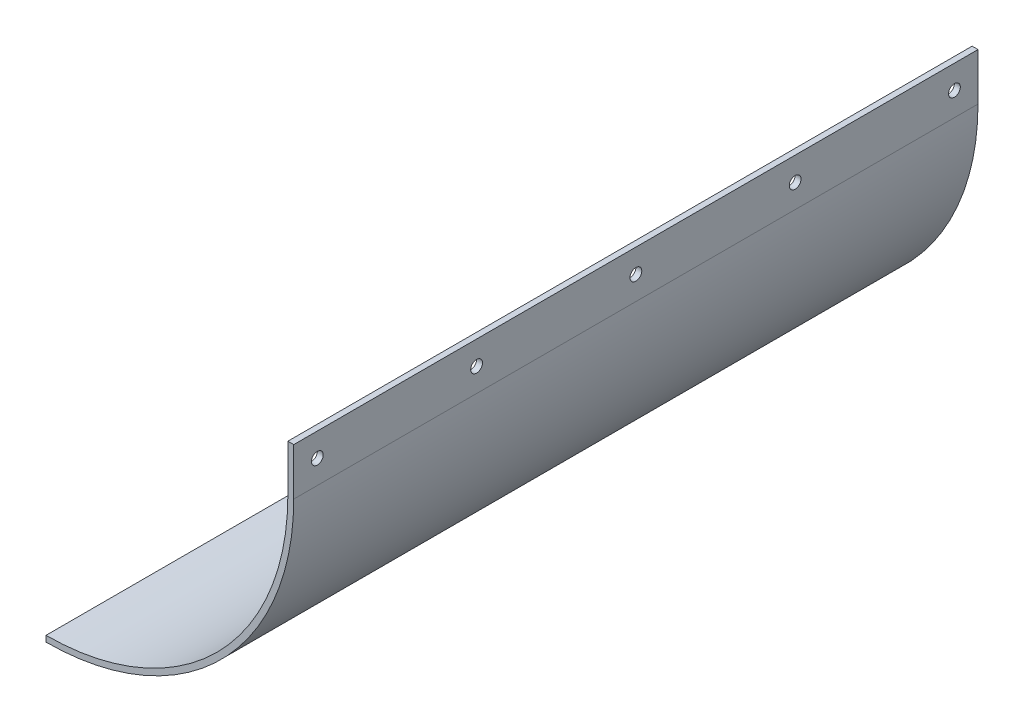
ISO-10303-21;
HEADER;
FILE_DESCRIPTION(('STEP AP214'),'2;1');
FILE_NAME('part.step','',(''),(''),'','','');
FILE_SCHEMA(('AUTOMOTIVE_DESIGN { 1 0 10303 214 1 1 1 1 }'));
ENDSEC;
DATA;
#1=APPLICATION_CONTEXT('core data for automotive mechanical design processes');
#2=APPLICATION_PROTOCOL_DEFINITION('international standard','automotive_design',2000,#1);
#3=PRODUCT_CONTEXT('',#1,'mechanical');
#4=PRODUCT('Part','Part','',(#3));
#5=PRODUCT_RELATED_PRODUCT_CATEGORY('part','',(#4));
#6=PRODUCT_DEFINITION_FORMATION('','',#4);
#7=PRODUCT_DEFINITION_CONTEXT('part definition',#1,'design');
#8=PRODUCT_DEFINITION('design','',#6,#7);
#9=PRODUCT_DEFINITION_SHAPE('','',#8);
#10=(LENGTH_UNIT() NAMED_UNIT(*) SI_UNIT(.MILLI.,.METRE.));
#11=(NAMED_UNIT(*) PLANE_ANGLE_UNIT() SI_UNIT($,.RADIAN.));
#12=(NAMED_UNIT(*) SI_UNIT($,.STERADIAN.) SOLID_ANGLE_UNIT());
#13=UNCERTAINTY_MEASURE_WITH_UNIT(LENGTH_MEASURE(1.E-05),#10,'distance_accuracy_value','');
#14=(GEOMETRIC_REPRESENTATION_CONTEXT(3) GLOBAL_UNCERTAINTY_ASSIGNED_CONTEXT((#13)) GLOBAL_UNIT_ASSIGNED_CONTEXT((#10,
#11,#12)) REPRESENTATION_CONTEXT('',''));
#15=CARTESIAN_POINT('',(0.,0.,0.));
#16=DIRECTION('',(0.,0.,1.));
#17=DIRECTION('',(1.,0.,0.));
#18=AXIS2_PLACEMENT_3D('',#15,#16,#17);
#19=CARTESIAN_POINT('',(133.35,25.4,184.15));
#20=DIRECTION('',(1.,0.,0.));
#21=DIRECTION('',(0.,0.,-1.));
#22=AXIS2_PLACEMENT_3D('',#19,#20,#21);
#23=PLANE('',#22);
#24=CARTESIAN_POINT('',(133.35,12.7,-171.45));
#25=DIRECTION('',(1.,0.,0.));
#26=DIRECTION('',(0.,0.,-1.));
#27=AXIS2_PLACEMENT_3D('',#24,#25,#26);
#28=CIRCLE('',#27,3.175);
#29=CARTESIAN_POINT('',(133.35,12.7,-174.625));
#30=VERTEX_POINT('',#29);
#31=EDGE_CURVE('E218',#30,#30,#28,.T.);
#32=ORIENTED_EDGE('',*,*,#31,.F.);
#33=EDGE_LOOP('',(#32));
#34=FACE_BOUND('',#33,.T.);
#35=CARTESIAN_POINT('',(133.35,12.7,171.45));
#36=DIRECTION('',(1.,0.,0.));
#37=DIRECTION('',(0.,0.,-1.));
#38=AXIS2_PLACEMENT_3D('',#35,#36,#37);
#39=CIRCLE('',#38,3.175);
#40=CARTESIAN_POINT('',(133.35,12.7,168.275));
#41=VERTEX_POINT('',#40);
#42=EDGE_CURVE('E216',#41,#41,#39,.T.);
#43=ORIENTED_EDGE('',*,*,#42,.F.);
#44=EDGE_LOOP('',(#43));
#45=FACE_BOUND('',#44,.T.);
#46=CARTESIAN_POINT('',(133.35,12.7,85.725));
#47=DIRECTION('',(1.,0.,0.));
#48=DIRECTION('',(0.,0.,-1.));
#49=AXIS2_PLACEMENT_3D('',#46,#47,#48);
#50=CIRCLE('',#49,3.175);
#51=CARTESIAN_POINT('',(133.35,12.7,82.55));
#52=VERTEX_POINT('',#51);
#53=EDGE_CURVE('E160',#52,#52,#50,.T.);
#54=ORIENTED_EDGE('',*,*,#53,.F.);
#55=EDGE_LOOP('',(#54));
#56=FACE_BOUND('',#55,.T.);
#57=CARTESIAN_POINT('',(133.35,12.7,-85.725));
#58=DIRECTION('',(1.,0.,0.));
#59=DIRECTION('',(0.,0.,-1.));
#60=AXIS2_PLACEMENT_3D('',#57,#58,#59);
#61=CIRCLE('',#60,3.175);
#62=CARTESIAN_POINT('',(133.35,12.7,-88.9));
#63=VERTEX_POINT('',#62);
#64=EDGE_CURVE('E145',#63,#63,#61,.T.);
#65=ORIENTED_EDGE('',*,*,#64,.F.);
#66=EDGE_LOOP('',(#65));
#67=FACE_BOUND('',#66,.T.);
#68=CARTESIAN_POINT('',(133.35,12.7,0.));
#69=DIRECTION('',(1.,0.,0.));
#70=DIRECTION('',(0.,0.,-1.));
#71=AXIS2_PLACEMENT_3D('',#68,#69,#70);
#72=CIRCLE('',#71,3.175);
#73=CARTESIAN_POINT('',(133.35,12.7,-3.175));
#74=VERTEX_POINT('',#73);
#75=EDGE_CURVE('E140',#74,#74,#72,.T.);
#76=ORIENTED_EDGE('',*,*,#75,.F.);
#77=EDGE_LOOP('',(#76));
#78=FACE_BOUND('',#77,.T.);
#79=DIRECTION('',(0.,-1.,0.));
#80=VECTOR('',#79,1.);
#81=CARTESIAN_POINT('',(133.35,25.4,-184.15));
#82=LINE('',#81,#80);
#83=CARTESIAN_POINT('',(133.35,25.4,-184.15));
#84=VERTEX_POINT('',#83);
#85=CARTESIAN_POINT('',(133.35,0.,-184.15));
#86=VERTEX_POINT('',#85);
#87=EDGE_CURVE('E116',#84,#86,#82,.T.);
#88=ORIENTED_EDGE('',*,*,#87,.F.);
#89=DIRECTION('',(0.,0.,-1.));
#90=VECTOR('',#89,1.);
#91=CARTESIAN_POINT('',(133.35,25.4,184.15));
#92=LINE('',#91,#90);
#93=CARTESIAN_POINT('',(133.35,25.4,184.15));
#94=VERTEX_POINT('',#93);
#95=EDGE_CURVE('E11',#94,#84,#92,.T.);
#96=ORIENTED_EDGE('',*,*,#95,.F.);
#97=DIRECTION('',(0.,-1.,0.));
#98=VECTOR('',#97,1.);
#99=CARTESIAN_POINT('',(133.35,25.4,184.15));
#100=LINE('',#99,#98);
#101=CARTESIAN_POINT('',(133.35,0.,184.15));
#102=VERTEX_POINT('',#101);
#103=EDGE_CURVE('E131',#94,#102,#100,.T.);
#104=ORIENTED_EDGE('',*,*,#103,.T.);
#105=DIRECTION('',(0.,0.,-1.));
#106=VECTOR('',#105,1.);
#107=CARTESIAN_POINT('',(133.35,0.,184.15));
#108=LINE('',#107,#106);
#109=EDGE_CURVE('E82',#102,#86,#108,.T.);
#110=ORIENTED_EDGE('',*,*,#109,.T.);
#111=EDGE_LOOP('',(#88,#96,#104,#110));
#112=FACE_BOUND('',#111,.T.);
#113=ADVANCED_FACE('F32',(#34,#45,#56,#67,#78,#112),#23,.T.);
#114=CARTESIAN_POINT('',(130.175,25.4,184.15));
#115=DIRECTION('',(0.,1.,0.));
#116=DIRECTION('',(0.,0.,1.));
#117=AXIS2_PLACEMENT_3D('',#114,#115,#116);
#118=PLANE('',#117);
#119=DIRECTION('',(1.,0.,0.));
#120=VECTOR('',#119,1.);
#121=CARTESIAN_POINT('',(130.175,25.4,-184.15));
#122=LINE('',#121,#120);
#123=CARTESIAN_POINT('',(130.175,25.4,-184.15));
#124=VERTEX_POINT('',#123);
#125=EDGE_CURVE('E129',#124,#84,#122,.T.);
#126=ORIENTED_EDGE('',*,*,#125,.F.);
#127=DIRECTION('',(0.,0.,-1.));
#128=VECTOR('',#127,1.);
#129=CARTESIAN_POINT('',(130.175,25.4,184.15));
#130=LINE('',#129,#128);
#131=CARTESIAN_POINT('',(130.175,25.4,184.15));
#132=VERTEX_POINT('',#131);
#133=EDGE_CURVE('E41',#132,#124,#130,.T.);
#134=ORIENTED_EDGE('',*,*,#133,.F.);
#135=DIRECTION('',(1.,0.,0.));
#136=VECTOR('',#135,1.);
#137=CARTESIAN_POINT('',(130.175,25.4,184.15));
#138=LINE('',#137,#136);
#139=EDGE_CURVE('E111',#132,#94,#138,.T.);
#140=ORIENTED_EDGE('',*,*,#139,.T.);
#141=ORIENTED_EDGE('',*,*,#95,.T.);
#142=EDGE_LOOP('',(#126,#134,#140,#141));
#143=FACE_BOUND('',#142,.T.);
#144=ADVANCED_FACE('F170',(#143),#118,.T.);
#145=CARTESIAN_POINT('',(130.175,0.,184.15));
#146=DIRECTION('',(-1.,0.,0.));
#147=DIRECTION('',(0.,0.,1.));
#148=AXIS2_PLACEMENT_3D('',#145,#146,#147);
#149=PLANE('',#148);
#150=CARTESIAN_POINT('',(130.175,12.7,-171.45));
#151=DIRECTION('',(-1.,0.,0.));
#152=DIRECTION('',(0.,0.,1.));
#153=AXIS2_PLACEMENT_3D('',#150,#151,#152);
#154=CIRCLE('',#153,3.175);
#155=CARTESIAN_POINT('',(130.175,12.7,-168.275));
#156=VERTEX_POINT('',#155);
#157=EDGE_CURVE('E35',#156,#156,#154,.T.);
#158=ORIENTED_EDGE('',*,*,#157,.F.);
#159=EDGE_LOOP('',(#158));
#160=FACE_BOUND('',#159,.T.);
#161=CARTESIAN_POINT('',(130.175,12.7,171.45));
#162=DIRECTION('',(-1.,0.,0.));
#163=DIRECTION('',(0.,0.,1.));
#164=AXIS2_PLACEMENT_3D('',#161,#162,#163);
#165=CIRCLE('',#164,3.175);
#166=CARTESIAN_POINT('',(130.175,12.7,174.625));
#167=VERTEX_POINT('',#166);
#168=EDGE_CURVE('E147',#167,#167,#165,.T.);
#169=ORIENTED_EDGE('',*,*,#168,.F.);
#170=EDGE_LOOP('',(#169));
#171=FACE_BOUND('',#170,.T.);
#172=CARTESIAN_POINT('',(130.175,12.7,85.725));
#173=DIRECTION('',(-1.,0.,0.));
#174=DIRECTION('',(0.,0.,1.));
#175=AXIS2_PLACEMENT_3D('',#172,#173,#174);
#176=CIRCLE('',#175,3.175);
#177=CARTESIAN_POINT('',(130.175,12.7,88.9));
#178=VERTEX_POINT('',#177);
#179=EDGE_CURVE('E144',#178,#178,#176,.T.);
#180=ORIENTED_EDGE('',*,*,#179,.F.);
#181=EDGE_LOOP('',(#180));
#182=FACE_BOUND('',#181,.T.);
#183=CARTESIAN_POINT('',(130.175,12.7,-85.725));
#184=DIRECTION('',(-1.,0.,0.));
#185=DIRECTION('',(0.,0.,1.));
#186=AXIS2_PLACEMENT_3D('',#183,#184,#185);
#187=CIRCLE('',#186,3.175);
#188=CARTESIAN_POINT('',(130.175,12.7,-82.55));
#189=VERTEX_POINT('',#188);
#190=EDGE_CURVE('E141',#189,#189,#187,.T.);
#191=ORIENTED_EDGE('',*,*,#190,.F.);
#192=EDGE_LOOP('',(#191));
#193=FACE_BOUND('',#192,.T.);
#194=CARTESIAN_POINT('',(130.175,12.7,0.));
#195=DIRECTION('',(-1.,0.,0.));
#196=DIRECTION('',(0.,0.,1.));
#197=AXIS2_PLACEMENT_3D('',#194,#195,#196);
#198=CIRCLE('',#197,3.175);
#199=CARTESIAN_POINT('',(130.175,12.7,3.175));
#200=VERTEX_POINT('',#199);
#201=EDGE_CURVE('E120',#200,#200,#198,.T.);
#202=ORIENTED_EDGE('',*,*,#201,.F.);
#203=EDGE_LOOP('',(#202));
#204=FACE_BOUND('',#203,.T.);
#205=DIRECTION('',(0.,1.,0.));
#206=VECTOR('',#205,1.);
#207=CARTESIAN_POINT('',(130.175,0.,-184.15));
#208=LINE('',#207,#206);
#209=CARTESIAN_POINT('',(130.175,0.,-184.15));
#210=VERTEX_POINT('',#209);
#211=EDGE_CURVE('E96',#210,#124,#208,.T.);
#212=ORIENTED_EDGE('',*,*,#211,.F.);
#213=DIRECTION('',(0.,0.,-1.));
#214=VECTOR('',#213,1.);
#215=CARTESIAN_POINT('',(130.175,0.,184.15));
#216=LINE('',#215,#214);
#217=CARTESIAN_POINT('',(130.175,0.,184.15));
#218=VERTEX_POINT('',#217);
#219=EDGE_CURVE('E90',#218,#210,#216,.T.);
#220=ORIENTED_EDGE('',*,*,#219,.F.);
#221=DIRECTION('',(0.,1.,0.));
#222=VECTOR('',#221,1.);
#223=CARTESIAN_POINT('',(130.175,0.,184.15));
#224=LINE('',#223,#222);
#225=EDGE_CURVE('E94',#218,#132,#224,.T.);
#226=ORIENTED_EDGE('',*,*,#225,.T.);
#227=ORIENTED_EDGE('',*,*,#133,.T.);
#228=EDGE_LOOP('',(#212,#220,#226,#227));
#229=FACE_BOUND('',#228,.T.);
#230=ADVANCED_FACE('F92',(#160,#171,#182,#193,#204,#229),#149,.T.);
#231=CARTESIAN_POINT('',(0.,0.,184.15));
#232=DIRECTION('',(0.,0.,-1.));
#233=DIRECTION('',(-1.,0.,0.));
#234=AXIS2_PLACEMENT_3D('',#231,#232,#233);
#235=CYLINDRICAL_SURFACE('',#234,130.175);
#236=CARTESIAN_POINT('',(0.,0.,-184.15));
#237=DIRECTION('',(0.,0.,-1.));
#238=DIRECTION('',(-1.,0.,0.));
#239=AXIS2_PLACEMENT_3D('',#236,#237,#238);
#240=CIRCLE('',#239,130.175);
#241=CARTESIAN_POINT('',(0.,-130.175,-184.15));
#242=VERTEX_POINT('',#241);
#243=EDGE_CURVE('E126',#210,#242,#240,.T.);
#244=ORIENTED_EDGE('',*,*,#243,.T.);
#245=DIRECTION('',(0.,0.,-1.));
#246=VECTOR('',#245,1.);
#247=CARTESIAN_POINT('',(0.,-130.175,184.15));
#248=LINE('',#247,#246);
#249=CARTESIAN_POINT('',(0.,-130.175,184.15));
#250=VERTEX_POINT('',#249);
#251=EDGE_CURVE('E100',#250,#242,#248,.T.);
#252=ORIENTED_EDGE('',*,*,#251,.F.);
#253=CARTESIAN_POINT('',(0.,0.,184.15));
#254=DIRECTION('',(0.,0.,-1.));
#255=DIRECTION('',(-1.,0.,0.));
#256=AXIS2_PLACEMENT_3D('',#253,#254,#255);
#257=CIRCLE('',#256,130.175);
#258=EDGE_CURVE('E103',#218,#250,#257,.T.);
#259=ORIENTED_EDGE('',*,*,#258,.F.);
#260=ORIENTED_EDGE('',*,*,#219,.T.);
#261=EDGE_LOOP('',(#244,#252,#259,#260));
#262=FACE_BOUND('',#261,.T.);
#263=ADVANCED_FACE('F104',(#262),#235,.F.);
#264=CARTESIAN_POINT('',(0.,-133.35,184.15));
#265=DIRECTION('',(-1.,0.,0.));
#266=DIRECTION('',(0.,0.,1.));
#267=AXIS2_PLACEMENT_3D('',#264,#265,#266);
#268=PLANE('',#267);
#269=DIRECTION('',(0.,1.,0.));
#270=VECTOR('',#269,1.);
#271=CARTESIAN_POINT('',(0.,-133.35,-184.15));
#272=LINE('',#271,#270);
#273=CARTESIAN_POINT('',(0.,-133.35,-184.15));
#274=VERTEX_POINT('',#273);
#275=EDGE_CURVE('E123',#274,#242,#272,.T.);
#276=ORIENTED_EDGE('',*,*,#275,.F.);
#277=DIRECTION('',(0.,0.,-1.));
#278=VECTOR('',#277,1.);
#279=CARTESIAN_POINT('',(0.,-133.35,184.15));
#280=LINE('',#279,#278);
#281=CARTESIAN_POINT('',(0.,-133.35,184.15));
#282=VERTEX_POINT('',#281);
#283=EDGE_CURVE('E135',#282,#274,#280,.T.);
#284=ORIENTED_EDGE('',*,*,#283,.F.);
#285=DIRECTION('',(0.,1.,0.));
#286=VECTOR('',#285,1.);
#287=CARTESIAN_POINT('',(0.,-133.35,184.15));
#288=LINE('',#287,#286);
#289=EDGE_CURVE('E108',#282,#250,#288,.T.);
#290=ORIENTED_EDGE('',*,*,#289,.T.);
#291=ORIENTED_EDGE('',*,*,#251,.T.);
#292=EDGE_LOOP('',(#276,#284,#290,#291));
#293=FACE_BOUND('',#292,.T.);
#294=ADVANCED_FACE('F166',(#293),#268,.T.);
#295=CARTESIAN_POINT('',(0.,0.,184.15));
#296=DIRECTION('',(0.,0.,-1.));
#297=DIRECTION('',(-1.,0.,0.));
#298=AXIS2_PLACEMENT_3D('',#295,#296,#297);
#299=CYLINDRICAL_SURFACE('',#298,133.35);
#300=CARTESIAN_POINT('',(0.,0.,-184.15));
#301=DIRECTION('',(0.,0.,-1.));
#302=DIRECTION('',(-1.,0.,0.));
#303=AXIS2_PLACEMENT_3D('',#300,#301,#302);
#304=CIRCLE('',#303,133.35);
#305=EDGE_CURVE('E119',#86,#274,#304,.T.);
#306=ORIENTED_EDGE('',*,*,#305,.F.);
#307=ORIENTED_EDGE('',*,*,#109,.F.);
#308=CARTESIAN_POINT('',(0.,0.,184.15));
#309=DIRECTION('',(0.,0.,-1.));
#310=DIRECTION('',(-1.,0.,0.));
#311=AXIS2_PLACEMENT_3D('',#308,#309,#310);
#312=CIRCLE('',#311,133.35);
#313=EDGE_CURVE('E163',#102,#282,#312,.T.);
#314=ORIENTED_EDGE('',*,*,#313,.T.);
#315=ORIENTED_EDGE('',*,*,#283,.T.);
#316=EDGE_LOOP('',(#306,#307,#314,#315));
#317=FACE_BOUND('',#316,.T.);
#318=ADVANCED_FACE('F167',(#317),#299,.T.);
#319=CARTESIAN_POINT('',(0.,0.,184.15));
#320=DIRECTION('',(0.,0.,-1.));
#321=DIRECTION('',(-1.,0.,0.));
#322=AXIS2_PLACEMENT_3D('',#319,#320,#321);
#323=PLANE('',#322);
#324=ORIENTED_EDGE('',*,*,#103,.F.);
#325=ORIENTED_EDGE('',*,*,#139,.F.);
#326=ORIENTED_EDGE('',*,*,#225,.F.);
#327=ORIENTED_EDGE('',*,*,#258,.T.);
#328=ORIENTED_EDGE('',*,*,#289,.F.);
#329=ORIENTED_EDGE('',*,*,#313,.F.);
#330=EDGE_LOOP('',(#324,#325,#326,#327,#328,#329));
#331=FACE_BOUND('',#330,.T.);
#332=ADVANCED_FACE('F110',(#331),#323,.F.);
#333=CARTESIAN_POINT('',(0.,0.,-184.15));
#334=DIRECTION('',(0.,0.,-1.));
#335=DIRECTION('',(-1.,0.,0.));
#336=AXIS2_PLACEMENT_3D('',#333,#334,#335);
#337=PLANE('',#336);
#338=ORIENTED_EDGE('',*,*,#87,.T.);
#339=ORIENTED_EDGE('',*,*,#305,.T.);
#340=ORIENTED_EDGE('',*,*,#275,.T.);
#341=ORIENTED_EDGE('',*,*,#243,.F.);
#342=ORIENTED_EDGE('',*,*,#211,.T.);
#343=ORIENTED_EDGE('',*,*,#125,.T.);
#344=EDGE_LOOP('',(#338,#339,#340,#341,#342,#343));
#345=FACE_BOUND('',#344,.T.);
#346=ADVANCED_FACE('F169',(#345),#337,.T.);
#347=CARTESIAN_POINT('',(-247.65,12.7,0.));
#348=DIRECTION('',(1.,0.,0.));
#349=DIRECTION('',(0.,0.,-1.));
#350=AXIS2_PLACEMENT_3D('',#347,#348,#349);
#351=CYLINDRICAL_SURFACE('',#350,3.175);
#352=ORIENTED_EDGE('',*,*,#201,.T.);
#353=EDGE_LOOP('',(#352));
#354=FACE_BOUND('',#353,.T.);
#355=ORIENTED_EDGE('',*,*,#75,.T.);
#356=EDGE_LOOP('',(#355));
#357=FACE_BOUND('',#356,.T.);
#358=ADVANCED_FACE('F193',(#354,#357),#351,.F.);
#359=CARTESIAN_POINT('',(-247.65,12.7,-85.725));
#360=DIRECTION('',(1.,0.,0.));
#361=DIRECTION('',(0.,0.,-1.));
#362=AXIS2_PLACEMENT_3D('',#359,#360,#361);
#363=CYLINDRICAL_SURFACE('',#362,3.175);
#364=ORIENTED_EDGE('',*,*,#190,.T.);
#365=EDGE_LOOP('',(#364));
#366=FACE_BOUND('',#365,.T.);
#367=ORIENTED_EDGE('',*,*,#64,.T.);
#368=EDGE_LOOP('',(#367));
#369=FACE_BOUND('',#368,.T.);
#370=ADVANCED_FACE('F197',(#366,#369),#363,.F.);
#371=CARTESIAN_POINT('',(-247.65,12.7,85.725));
#372=DIRECTION('',(1.,0.,0.));
#373=DIRECTION('',(0.,0.,-1.));
#374=AXIS2_PLACEMENT_3D('',#371,#372,#373);
#375=CYLINDRICAL_SURFACE('',#374,3.175);
#376=ORIENTED_EDGE('',*,*,#179,.T.);
#377=EDGE_LOOP('',(#376));
#378=FACE_BOUND('',#377,.T.);
#379=ORIENTED_EDGE('',*,*,#53,.T.);
#380=EDGE_LOOP('',(#379));
#381=FACE_BOUND('',#380,.T.);
#382=ADVANCED_FACE('F199',(#378,#381),#375,.F.);
#383=CARTESIAN_POINT('',(-247.65,12.7,171.45));
#384=DIRECTION('',(1.,0.,0.));
#385=DIRECTION('',(0.,0.,-1.));
#386=AXIS2_PLACEMENT_3D('',#383,#384,#385);
#387=CYLINDRICAL_SURFACE('',#386,3.175);
#388=ORIENTED_EDGE('',*,*,#168,.T.);
#389=EDGE_LOOP('',(#388));
#390=FACE_BOUND('',#389,.T.);
#391=ORIENTED_EDGE('',*,*,#42,.T.);
#392=EDGE_LOOP('',(#391));
#393=FACE_BOUND('',#392,.T.);
#394=ADVANCED_FACE('F202',(#390,#393),#387,.F.);
#395=CARTESIAN_POINT('',(-247.65,12.7,-171.45));
#396=DIRECTION('',(1.,0.,0.));
#397=DIRECTION('',(0.,0.,-1.));
#398=AXIS2_PLACEMENT_3D('',#395,#396,#397);
#399=CYLINDRICAL_SURFACE('',#398,3.175);
#400=ORIENTED_EDGE('',*,*,#157,.T.);
#401=EDGE_LOOP('',(#400));
#402=FACE_BOUND('',#401,.T.);
#403=ORIENTED_EDGE('',*,*,#31,.T.);
#404=EDGE_LOOP('',(#403));
#405=FACE_BOUND('',#404,.T.);
#406=ADVANCED_FACE('F207',(#402,#405),#399,.F.);
#407=CLOSED_SHELL('',(#113,#144,#230,#263,#294,#318,#332,#346,#358,#370,#382,#394,#406));
#408=MANIFOLD_SOLID_BREP('B2',#407);
#409=ADVANCED_BREP_SHAPE_REPRESENTATION('',(#18,#408),#14);
#410=SHAPE_DEFINITION_REPRESENTATION(#9,#409);
ENDSEC;
END-ISO-10303-21;
